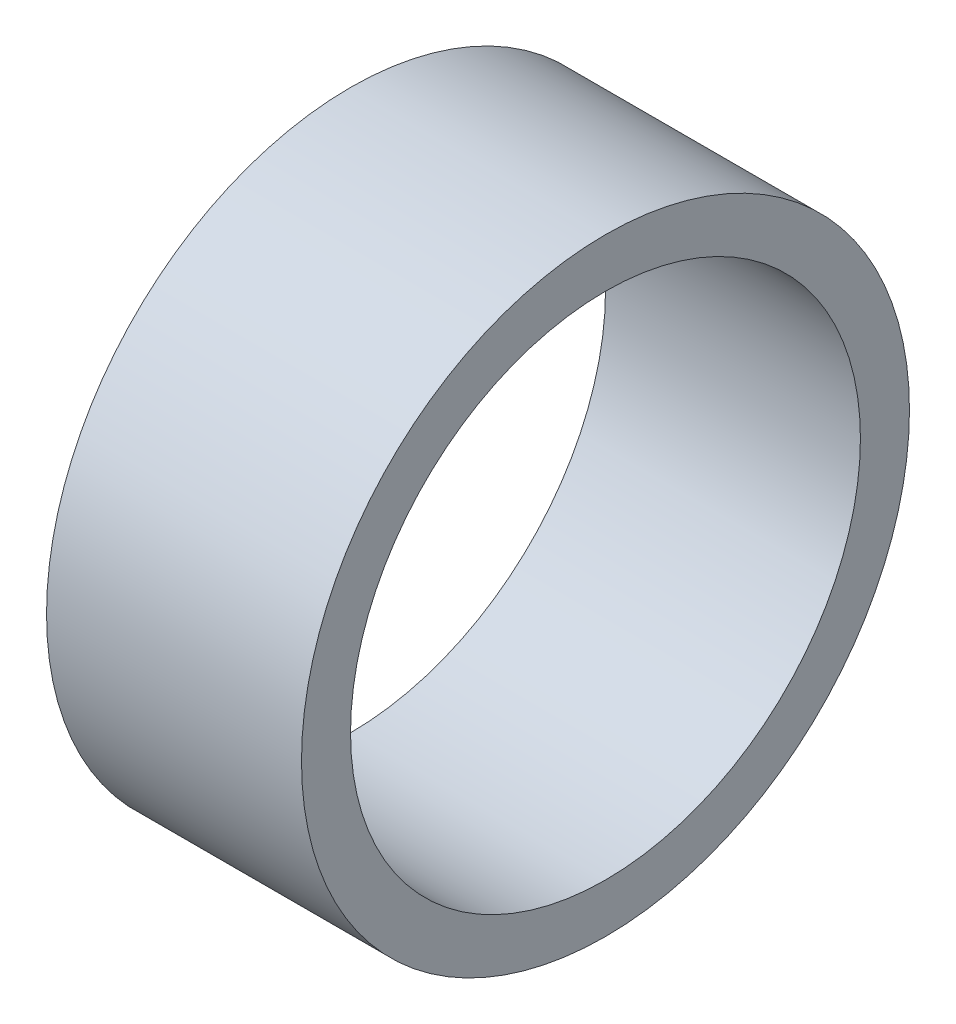
ISO-10303-21;
HEADER;
FILE_DESCRIPTION(('STEP AP214'),'2;1');
FILE_NAME('part.step','',(''),(''),'','','');
FILE_SCHEMA(('AUTOMOTIVE_DESIGN { 1 0 10303 214 1 1 1 1 }'));
ENDSEC;
DATA;
#1=APPLICATION_CONTEXT('core data for automotive mechanical design processes');
#2=APPLICATION_PROTOCOL_DEFINITION('international standard','automotive_design',2000,#1);
#3=PRODUCT_CONTEXT('',#1,'mechanical');
#4=PRODUCT('Part','Part','',(#3));
#5=PRODUCT_RELATED_PRODUCT_CATEGORY('part','',(#4));
#6=PRODUCT_DEFINITION_FORMATION('','',#4);
#7=PRODUCT_DEFINITION_CONTEXT('part definition',#1,'design');
#8=PRODUCT_DEFINITION('design','',#6,#7);
#9=PRODUCT_DEFINITION_SHAPE('','',#8);
#10=(LENGTH_UNIT() NAMED_UNIT(*) SI_UNIT(.MILLI.,.METRE.));
#11=(NAMED_UNIT(*) PLANE_ANGLE_UNIT() SI_UNIT($,.RADIAN.));
#12=(NAMED_UNIT(*) SI_UNIT($,.STERADIAN.) SOLID_ANGLE_UNIT());
#13=UNCERTAINTY_MEASURE_WITH_UNIT(LENGTH_MEASURE(1.E-05),#10,'distance_accuracy_value','');
#14=(GEOMETRIC_REPRESENTATION_CONTEXT(3) GLOBAL_UNCERTAINTY_ASSIGNED_CONTEXT((#13)) GLOBAL_UNIT_ASSIGNED_CONTEXT((#10,
#11,#12)) REPRESENTATION_CONTEXT('',''));
#15=CARTESIAN_POINT('',(0.,0.,0.));
#16=DIRECTION('',(0.,0.,1.));
#17=DIRECTION('',(1.,0.,0.));
#18=AXIS2_PLACEMENT_3D('',#15,#16,#17);
#19=CARTESIAN_POINT('',(26.,0.,0.));
#20=DIRECTION('',(1.,0.,0.));
#21=DIRECTION('',(0.,0.,-1.));
#22=AXIS2_PLACEMENT_3D('',#19,#20,#21);
#23=PLANE('',#22);
#24=CARTESIAN_POINT('',(26.,0.,0.));
#25=DIRECTION('',(1.,0.,0.));
#26=DIRECTION('',(0.,0.,-1.));
#27=AXIS2_PLACEMENT_3D('',#24,#25,#26);
#28=CIRCLE('',#27,31.);
#29=CARTESIAN_POINT('',(26.,0.,-31.));
#30=VERTEX_POINT('',#29);
#31=EDGE_CURVE('E10',#30,#30,#28,.T.);
#32=ORIENTED_EDGE('',*,*,#31,.T.);
#33=EDGE_LOOP('',(#32));
#34=FACE_BOUND('',#33,.T.);
#35=CARTESIAN_POINT('',(26.,0.,0.));
#36=DIRECTION('',(1.,0.,0.));
#37=DIRECTION('',(0.,0.,-1.));
#38=AXIS2_PLACEMENT_3D('',#35,#36,#37);
#39=CIRCLE('',#38,26.);
#40=CARTESIAN_POINT('',(26.,0.,-26.));
#41=VERTEX_POINT('',#40);
#42=EDGE_CURVE('E43',#41,#41,#39,.T.);
#43=ORIENTED_EDGE('',*,*,#42,.F.);
#44=EDGE_LOOP('',(#43));
#45=FACE_BOUND('',#44,.T.);
#46=ADVANCED_FACE('F32',(#34,#45),#23,.T.);
#47=CARTESIAN_POINT('',(0.,0.,0.));
#48=DIRECTION('',(1.,0.,0.));
#49=DIRECTION('',(0.,0.,-1.));
#50=AXIS2_PLACEMENT_3D('',#47,#48,#49);
#51=PLANE('',#50);
#52=CARTESIAN_POINT('',(0.,0.,0.));
#53=DIRECTION('',(1.,0.,0.));
#54=DIRECTION('',(0.,0.,-1.));
#55=AXIS2_PLACEMENT_3D('',#52,#53,#54);
#56=CIRCLE('',#55,31.);
#57=CARTESIAN_POINT('',(0.,0.,-31.));
#58=VERTEX_POINT('',#57);
#59=EDGE_CURVE('E36',#58,#58,#56,.T.);
#60=ORIENTED_EDGE('',*,*,#59,.F.);
#61=EDGE_LOOP('',(#60));
#62=FACE_BOUND('',#61,.T.);
#63=CARTESIAN_POINT('',(0.,0.,0.));
#64=DIRECTION('',(1.,0.,0.));
#65=DIRECTION('',(0.,0.,-1.));
#66=AXIS2_PLACEMENT_3D('',#63,#64,#65);
#67=CIRCLE('',#66,26.);
#68=CARTESIAN_POINT('',(0.,0.,-26.));
#69=VERTEX_POINT('',#68);
#70=EDGE_CURVE('E45',#69,#69,#67,.T.);
#71=ORIENTED_EDGE('',*,*,#70,.T.);
#72=EDGE_LOOP('',(#71));
#73=FACE_BOUND('',#72,.T.);
#74=ADVANCED_FACE('F55',(#62,#73),#51,.F.);
#75=CARTESIAN_POINT('',(26.,0.,0.));
#76=DIRECTION('',(-1.,0.,0.));
#77=DIRECTION('',(0.,0.,1.));
#78=AXIS2_PLACEMENT_3D('',#75,#76,#77);
#79=CYLINDRICAL_SURFACE('',#78,31.);
#80=ORIENTED_EDGE('',*,*,#31,.F.);
#81=EDGE_LOOP('',(#80));
#82=FACE_BOUND('',#81,.T.);
#83=ORIENTED_EDGE('',*,*,#59,.T.);
#84=EDGE_LOOP('',(#83));
#85=FACE_BOUND('',#84,.T.);
#86=ADVANCED_FACE('F34',(#82,#85),#79,.T.);
#87=CARTESIAN_POINT('',(26.,0.,0.));
#88=DIRECTION('',(-1.,0.,0.));
#89=DIRECTION('',(0.,0.,1.));
#90=AXIS2_PLACEMENT_3D('',#87,#88,#89);
#91=CYLINDRICAL_SURFACE('',#90,26.);
#92=ORIENTED_EDGE('',*,*,#42,.T.);
#93=EDGE_LOOP('',(#92));
#94=FACE_BOUND('',#93,.T.);
#95=ORIENTED_EDGE('',*,*,#70,.F.);
#96=EDGE_LOOP('',(#95));
#97=FACE_BOUND('',#96,.T.);
#98=ADVANCED_FACE('F51',(#94,#97),#91,.F.);
#99=CLOSED_SHELL('',(#46,#74,#86,#98));
#100=MANIFOLD_SOLID_BREP('B2',#99);
#101=ADVANCED_BREP_SHAPE_REPRESENTATION('',(#18,#100),#14);
#102=SHAPE_DEFINITION_REPRESENTATION(#9,#101);
ENDSEC;
END-ISO-10303-21;
